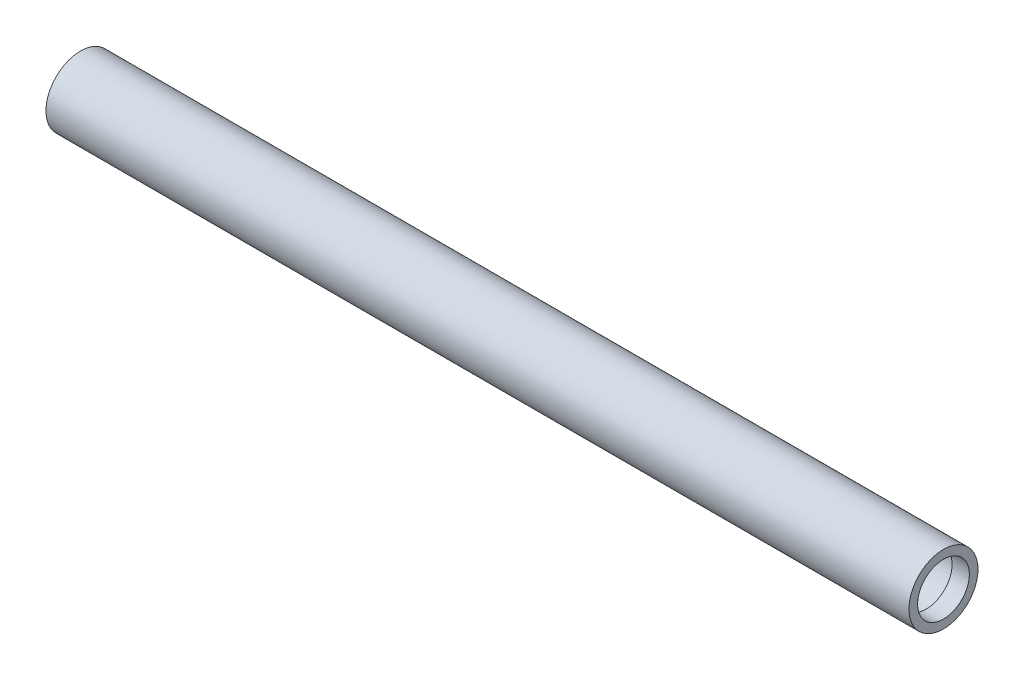
ISO-10303-21;
HEADER;
FILE_DESCRIPTION(('STEP AP214'),'2;1');
FILE_NAME('part.step','',(''),(''),'','','');
FILE_SCHEMA(('AUTOMOTIVE_DESIGN { 1 0 10303 214 1 1 1 1 }'));
ENDSEC;
DATA;
#1=APPLICATION_CONTEXT('core data for automotive mechanical design processes');
#2=APPLICATION_PROTOCOL_DEFINITION('international standard','automotive_design',2000,#1);
#3=PRODUCT_CONTEXT('',#1,'mechanical');
#4=PRODUCT('Part','Part','',(#3));
#5=PRODUCT_RELATED_PRODUCT_CATEGORY('part','',(#4));
#6=PRODUCT_DEFINITION_FORMATION('','',#4);
#7=PRODUCT_DEFINITION_CONTEXT('part definition',#1,'design');
#8=PRODUCT_DEFINITION('design','',#6,#7);
#9=PRODUCT_DEFINITION_SHAPE('','',#8);
#10=(LENGTH_UNIT() NAMED_UNIT(*) SI_UNIT(.MILLI.,.METRE.));
#11=(NAMED_UNIT(*) PLANE_ANGLE_UNIT() SI_UNIT($,.RADIAN.));
#12=(NAMED_UNIT(*) SI_UNIT($,.STERADIAN.) SOLID_ANGLE_UNIT());
#13=UNCERTAINTY_MEASURE_WITH_UNIT(LENGTH_MEASURE(1.E-05),#10,'distance_accuracy_value','');
#14=(GEOMETRIC_REPRESENTATION_CONTEXT(3) GLOBAL_UNCERTAINTY_ASSIGNED_CONTEXT((#13)) GLOBAL_UNIT_ASSIGNED_CONTEXT((#10,
#11,#12)) REPRESENTATION_CONTEXT('',''));
#15=CARTESIAN_POINT('',(0.,0.,0.));
#16=DIRECTION('',(0.,0.,1.));
#17=DIRECTION('',(1.,0.,0.));
#18=AXIS2_PLACEMENT_3D('',#15,#16,#17);
#19=CARTESIAN_POINT('',(500.,0.,0.));
#20=DIRECTION('',(-1.,0.,0.));
#21=DIRECTION('',(0.,0.,1.));
#22=AXIS2_PLACEMENT_3D('',#19,#20,#21);
#23=CYLINDRICAL_SURFACE('',#22,18.);
#24=CARTESIAN_POINT('',(10.,0.,0.));
#25=DIRECTION('',(-1.,0.,0.));
#26=DIRECTION('',(0.,0.,1.));
#27=AXIS2_PLACEMENT_3D('',#24,#25,#26);
#28=CIRCLE('',#27,18.);
#29=CARTESIAN_POINT('',(10.,0.,18.));
#30=VERTEX_POINT('',#29);
#31=EDGE_CURVE('E42',#30,#30,#28,.T.);
#32=ORIENTED_EDGE('',*,*,#31,.T.);
#33=EDGE_LOOP('',(#32));
#34=FACE_BOUND('',#33,.T.);
#35=CARTESIAN_POINT('',(490.,0.,0.));
#36=DIRECTION('',(1.,0.,0.));
#37=DIRECTION('',(0.,0.,-1.));
#38=AXIS2_PLACEMENT_3D('',#35,#36,#37);
#39=CIRCLE('',#38,18.);
#40=CARTESIAN_POINT('',(490.,0.,-18.));
#41=VERTEX_POINT('',#40);
#42=EDGE_CURVE('E50',#41,#41,#39,.T.);
#43=ORIENTED_EDGE('',*,*,#42,.T.);
#44=EDGE_LOOP('',(#43));
#45=FACE_BOUND('',#44,.T.);
#46=ADVANCED_FACE('F31',(#34,#45),#23,.F.);
#47=CARTESIAN_POINT('',(500.,0.,0.));
#48=DIRECTION('',(1.,0.,0.));
#49=DIRECTION('',(0.,0.,-1.));
#50=AXIS2_PLACEMENT_3D('',#47,#48,#49);
#51=PLANE('',#50);
#52=CARTESIAN_POINT('',(500.,0.,0.));
#53=DIRECTION('',(1.,0.,0.));
#54=DIRECTION('',(0.,0.,-1.));
#55=AXIS2_PLACEMENT_3D('',#52,#53,#54);
#56=CIRCLE('',#55,20.);
#57=CARTESIAN_POINT('',(500.,0.,-20.));
#58=VERTEX_POINT('',#57);
#59=EDGE_CURVE('E10',#58,#58,#56,.T.);
#60=ORIENTED_EDGE('',*,*,#59,.T.);
#61=EDGE_LOOP('',(#60));
#62=FACE_BOUND('',#61,.T.);
#63=CARTESIAN_POINT('',(500.,0.,0.));
#64=DIRECTION('',(1.,0.,0.));
#65=DIRECTION('',(0.,0.,-1.));
#66=AXIS2_PLACEMENT_3D('',#63,#64,#65);
#67=CIRCLE('',#66,15.);
#68=CARTESIAN_POINT('',(500.,0.,-15.));
#69=VERTEX_POINT('',#68);
#70=EDGE_CURVE('E56',#69,#69,#67,.T.);
#71=ORIENTED_EDGE('',*,*,#70,.F.);
#72=EDGE_LOOP('',(#71));
#73=FACE_BOUND('',#72,.T.);
#74=ADVANCED_FACE('F71',(#62,#73),#51,.T.);
#75=CARTESIAN_POINT('',(0.,0.,0.));
#76=DIRECTION('',(1.,0.,0.));
#77=DIRECTION('',(0.,0.,-1.));
#78=AXIS2_PLACEMENT_3D('',#75,#76,#77);
#79=PLANE('',#78);
#80=CARTESIAN_POINT('',(0.,0.,0.));
#81=DIRECTION('',(1.,0.,0.));
#82=DIRECTION('',(0.,0.,-1.));
#83=AXIS2_PLACEMENT_3D('',#80,#81,#82);
#84=CIRCLE('',#83,20.);
#85=CARTESIAN_POINT('',(0.,0.,-20.));
#86=VERTEX_POINT('',#85);
#87=EDGE_CURVE('E35',#86,#86,#84,.T.);
#88=ORIENTED_EDGE('',*,*,#87,.F.);
#89=EDGE_LOOP('',(#88));
#90=FACE_BOUND('',#89,.T.);
#91=CARTESIAN_POINT('',(0.,0.,0.));
#92=DIRECTION('',(-1.,0.,0.));
#93=DIRECTION('',(0.,0.,1.));
#94=AXIS2_PLACEMENT_3D('',#91,#92,#93);
#95=CIRCLE('',#94,10.);
#96=CARTESIAN_POINT('',(0.,0.,10.));
#97=VERTEX_POINT('',#96);
#98=EDGE_CURVE('E47',#97,#97,#95,.T.);
#99=ORIENTED_EDGE('',*,*,#98,.F.);
#100=EDGE_LOOP('',(#99));
#101=FACE_BOUND('',#100,.T.);
#102=ADVANCED_FACE('F73',(#90,#101),#79,.F.);
#103=CARTESIAN_POINT('',(500.,0.,0.));
#104=DIRECTION('',(-1.,0.,0.));
#105=DIRECTION('',(0.,0.,1.));
#106=AXIS2_PLACEMENT_3D('',#103,#104,#105);
#107=CYLINDRICAL_SURFACE('',#106,20.);
#108=ORIENTED_EDGE('',*,*,#59,.F.);
#109=EDGE_LOOP('',(#108));
#110=FACE_BOUND('',#109,.T.);
#111=ORIENTED_EDGE('',*,*,#87,.T.);
#112=EDGE_LOOP('',(#111));
#113=FACE_BOUND('',#112,.T.);
#114=ADVANCED_FACE('F33',(#110,#113),#107,.T.);
#115=CARTESIAN_POINT('',(10.,0.,0.));
#116=DIRECTION('',(-1.,0.,0.));
#117=DIRECTION('',(0.,0.,1.));
#118=AXIS2_PLACEMENT_3D('',#115,#116,#117);
#119=PLANE('',#118);
#120=CARTESIAN_POINT('',(10.,0.,0.));
#121=DIRECTION('',(-1.,0.,0.));
#122=DIRECTION('',(0.,0.,1.));
#123=AXIS2_PLACEMENT_3D('',#120,#121,#122);
#124=CIRCLE('',#123,10.);
#125=CARTESIAN_POINT('',(10.,0.,10.));
#126=VERTEX_POINT('',#125);
#127=EDGE_CURVE('E46',#126,#126,#124,.T.);
#128=ORIENTED_EDGE('',*,*,#127,.T.);
#129=EDGE_LOOP('',(#128));
#130=FACE_BOUND('',#129,.T.);
#131=ORIENTED_EDGE('',*,*,#31,.F.);
#132=EDGE_LOOP('',(#131));
#133=FACE_BOUND('',#132,.T.);
#134=ADVANCED_FACE('F83',(#130,#133),#119,.F.);
#135=CARTESIAN_POINT('',(10.,0.,0.));
#136=DIRECTION('',(-1.,0.,0.));
#137=DIRECTION('',(0.,0.,1.));
#138=AXIS2_PLACEMENT_3D('',#135,#136,#137);
#139=CYLINDRICAL_SURFACE('',#138,10.);
#140=ORIENTED_EDGE('',*,*,#127,.F.);
#141=EDGE_LOOP('',(#140));
#142=FACE_BOUND('',#141,.T.);
#143=ORIENTED_EDGE('',*,*,#98,.T.);
#144=EDGE_LOOP('',(#143));
#145=FACE_BOUND('',#144,.T.);
#146=ADVANCED_FACE('F86',(#142,#145),#139,.F.);
#147=CARTESIAN_POINT('',(490.,0.,0.));
#148=DIRECTION('',(1.,0.,0.));
#149=DIRECTION('',(0.,0.,-1.));
#150=AXIS2_PLACEMENT_3D('',#147,#148,#149);
#151=PLANE('',#150);
#152=CARTESIAN_POINT('',(490.,0.,0.));
#153=DIRECTION('',(1.,0.,0.));
#154=DIRECTION('',(0.,0.,-1.));
#155=AXIS2_PLACEMENT_3D('',#152,#153,#154);
#156=CIRCLE('',#155,15.);
#157=CARTESIAN_POINT('',(490.,0.,-15.));
#158=VERTEX_POINT('',#157);
#159=EDGE_CURVE('E55',#158,#158,#156,.T.);
#160=ORIENTED_EDGE('',*,*,#159,.T.);
#161=EDGE_LOOP('',(#160));
#162=FACE_BOUND('',#161,.T.);
#163=ORIENTED_EDGE('',*,*,#42,.F.);
#164=EDGE_LOOP('',(#163));
#165=FACE_BOUND('',#164,.T.);
#166=ADVANCED_FACE('F62',(#162,#165),#151,.F.);
#167=CARTESIAN_POINT('',(490.,0.,0.));
#168=DIRECTION('',(1.,0.,0.));
#169=DIRECTION('',(0.,0.,-1.));
#170=AXIS2_PLACEMENT_3D('',#167,#168,#169);
#171=CYLINDRICAL_SURFACE('',#170,15.);
#172=ORIENTED_EDGE('',*,*,#159,.F.);
#173=EDGE_LOOP('',(#172));
#174=FACE_BOUND('',#173,.T.);
#175=ORIENTED_EDGE('',*,*,#70,.T.);
#176=EDGE_LOOP('',(#175));
#177=FACE_BOUND('',#176,.T.);
#178=ADVANCED_FACE('F65',(#174,#177),#171,.F.);
#179=CLOSED_SHELL('',(#46,#74,#102,#114,#134,#146,#166,#178));
#180=MANIFOLD_SOLID_BREP('B2',#179);
#181=ADVANCED_BREP_SHAPE_REPRESENTATION('',(#18,#180),#14);
#182=SHAPE_DEFINITION_REPRESENTATION(#9,#181);
ENDSEC;
END-ISO-10303-21;
